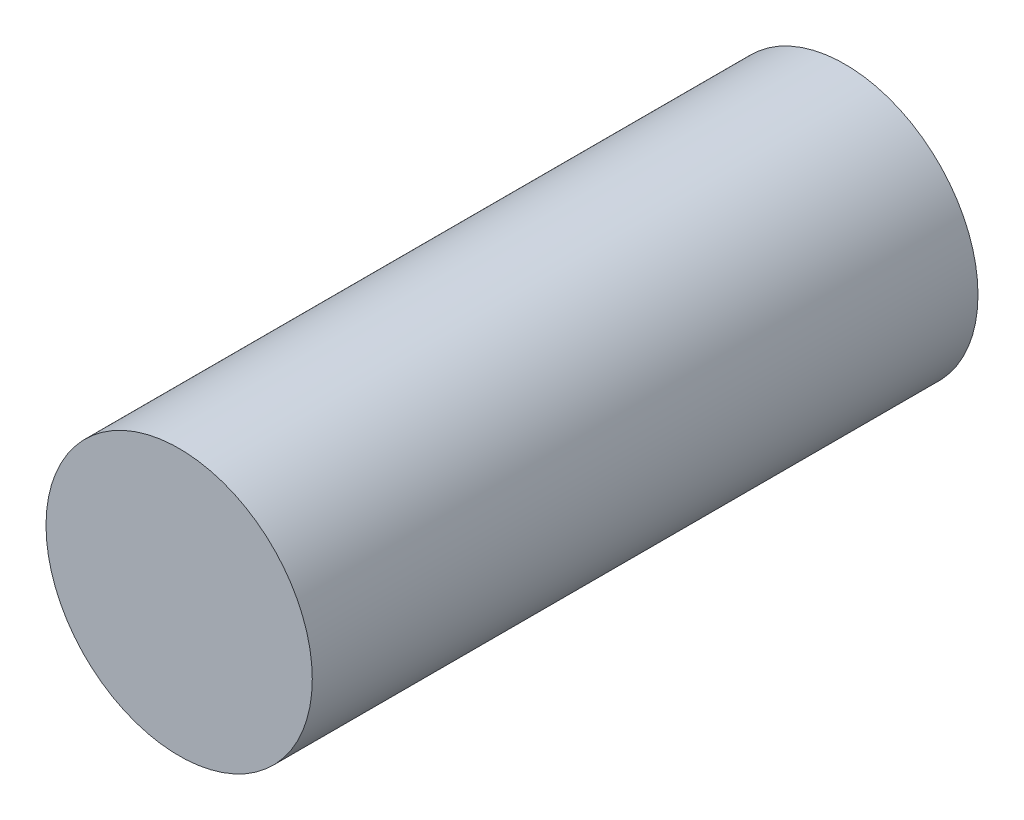
ISO-10303-21;
HEADER;
FILE_DESCRIPTION(('STEP AP214'),'2;1');
FILE_NAME('part.step','',(''),(''),'','','');
FILE_SCHEMA(('AUTOMOTIVE_DESIGN { 1 0 10303 214 1 1 1 1 }'));
ENDSEC;
DATA;
#1=APPLICATION_CONTEXT('core data for automotive mechanical design processes');
#2=APPLICATION_PROTOCOL_DEFINITION('international standard','automotive_design',2000,#1);
#3=PRODUCT_CONTEXT('',#1,'mechanical');
#4=PRODUCT('Part','Part','',(#3));
#5=PRODUCT_RELATED_PRODUCT_CATEGORY('part','',(#4));
#6=PRODUCT_DEFINITION_FORMATION('','',#4);
#7=PRODUCT_DEFINITION_CONTEXT('part definition',#1,'design');
#8=PRODUCT_DEFINITION('design','',#6,#7);
#9=PRODUCT_DEFINITION_SHAPE('','',#8);
#10=(LENGTH_UNIT() NAMED_UNIT(*) SI_UNIT(.MILLI.,.METRE.));
#11=(NAMED_UNIT(*) PLANE_ANGLE_UNIT() SI_UNIT($,.RADIAN.));
#12=(NAMED_UNIT(*) SI_UNIT($,.STERADIAN.) SOLID_ANGLE_UNIT());
#13=UNCERTAINTY_MEASURE_WITH_UNIT(LENGTH_MEASURE(1.E-05),#10,'distance_accuracy_value','');
#14=(GEOMETRIC_REPRESENTATION_CONTEXT(3) GLOBAL_UNCERTAINTY_ASSIGNED_CONTEXT((#13)) GLOBAL_UNIT_ASSIGNED_CONTEXT((#10,
#11,#12)) REPRESENTATION_CONTEXT('',''));
#15=CARTESIAN_POINT('',(0.,0.,0.));
#16=DIRECTION('',(0.,0.,1.));
#17=DIRECTION('',(1.,0.,0.));
#18=AXIS2_PLACEMENT_3D('',#15,#16,#17);
#19=CARTESIAN_POINT('',(0.,0.,30.));
#20=DIRECTION('',(0.,0.,-1.));
#21=DIRECTION('',(-1.,0.,0.));
#22=AXIS2_PLACEMENT_3D('',#19,#20,#21);
#23=CYLINDRICAL_SURFACE('',#22,6.);
#24=CARTESIAN_POINT('',(0.,0.,30.));
#25=DIRECTION('',(0.,0.,1.));
#26=DIRECTION('',(1.,0.,0.));
#27=AXIS2_PLACEMENT_3D('',#24,#25,#26);
#28=CIRCLE('',#27,6.);
#29=CARTESIAN_POINT('',(6.,0.,30.));
#30=VERTEX_POINT('',#29);
#31=EDGE_CURVE('E10',#30,#30,#28,.T.);
#32=ORIENTED_EDGE('',*,*,#31,.F.);
#33=EDGE_LOOP('',(#32));
#34=FACE_BOUND('',#33,.T.);
#35=CARTESIAN_POINT('',(0.,0.,0.));
#36=DIRECTION('',(0.,0.,1.));
#37=DIRECTION('',(1.,0.,0.));
#38=AXIS2_PLACEMENT_3D('',#35,#36,#37);
#39=CIRCLE('',#38,6.);
#40=CARTESIAN_POINT('',(6.,0.,0.));
#41=VERTEX_POINT('',#40);
#42=EDGE_CURVE('E40',#41,#41,#39,.T.);
#43=ORIENTED_EDGE('',*,*,#42,.T.);
#44=EDGE_LOOP('',(#43));
#45=FACE_BOUND('',#44,.T.);
#46=ADVANCED_FACE('F37',(#34,#45),#23,.T.);
#47=CARTESIAN_POINT('',(0.,0.,30.));
#48=DIRECTION('',(0.,0.,1.));
#49=DIRECTION('',(1.,0.,0.));
#50=AXIS2_PLACEMENT_3D('',#47,#48,#49);
#51=PLANE('',#50);
#52=ORIENTED_EDGE('',*,*,#31,.T.);
#53=EDGE_LOOP('',(#52));
#54=FACE_BOUND('',#53,.T.);
#55=ADVANCED_FACE('F54',(#54),#51,.T.);
#56=CARTESIAN_POINT('',(0.,0.,0.));
#57=DIRECTION('',(0.,0.,1.));
#58=DIRECTION('',(1.,0.,0.));
#59=AXIS2_PLACEMENT_3D('',#56,#57,#58);
#60=PLANE('',#59);
#61=ORIENTED_EDGE('',*,*,#42,.F.);
#62=EDGE_LOOP('',(#61));
#63=FACE_BOUND('',#62,.T.);
#64=ADVANCED_FACE('F52',(#63),#60,.F.);
#65=CLOSED_SHELL('',(#46,#55,#64));
#66=MANIFOLD_SOLID_BREP('B2',#65);
#67=ADVANCED_BREP_SHAPE_REPRESENTATION('',(#18,#66),#14);
#68=SHAPE_DEFINITION_REPRESENTATION(#9,#67);
ENDSEC;
END-ISO-10303-21;
